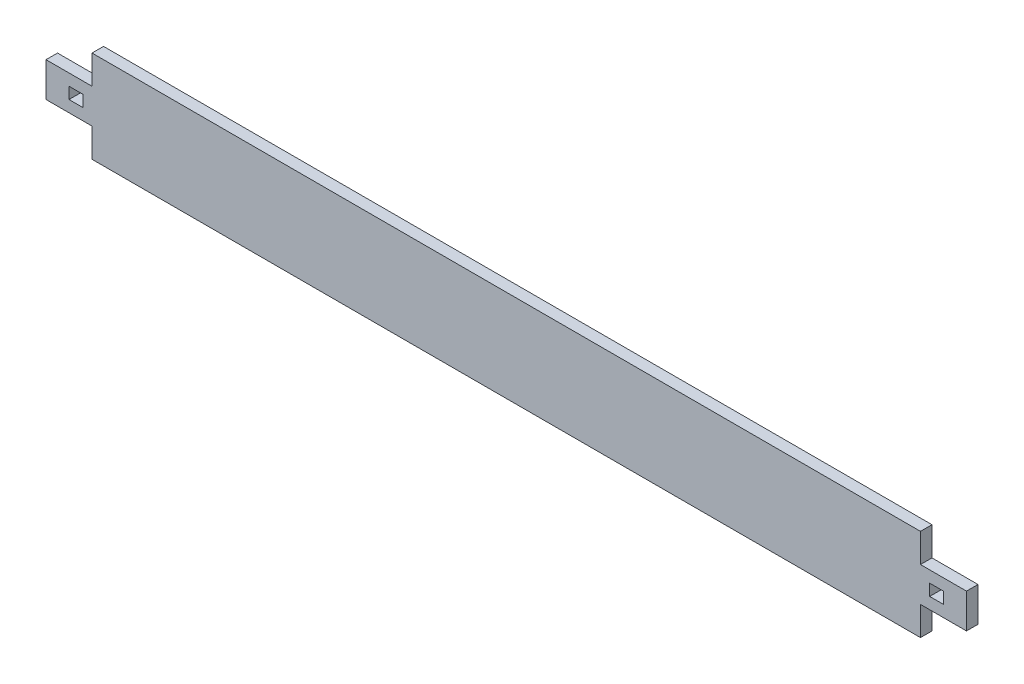
ISO-10303-21;
HEADER;
FILE_DESCRIPTION(('STEP AP214'),'2;1');
FILE_NAME('part.step','',(''),(''),'','','');
FILE_SCHEMA(('AUTOMOTIVE_DESIGN { 1 0 10303 214 1 1 1 1 }'));
ENDSEC;
DATA;
#1=APPLICATION_CONTEXT('core data for automotive mechanical design processes');
#2=APPLICATION_PROTOCOL_DEFINITION('international standard','automotive_design',2000,#1);
#3=PRODUCT_CONTEXT('',#1,'mechanical');
#4=PRODUCT('Part','Part','',(#3));
#5=PRODUCT_RELATED_PRODUCT_CATEGORY('part','',(#4));
#6=PRODUCT_DEFINITION_FORMATION('','',#4);
#7=PRODUCT_DEFINITION_CONTEXT('part definition',#1,'design');
#8=PRODUCT_DEFINITION('design','',#6,#7);
#9=PRODUCT_DEFINITION_SHAPE('','',#8);
#10=(LENGTH_UNIT() NAMED_UNIT(*) SI_UNIT(.MILLI.,.METRE.));
#11=(NAMED_UNIT(*) PLANE_ANGLE_UNIT() SI_UNIT($,.RADIAN.));
#12=(NAMED_UNIT(*) SI_UNIT($,.STERADIAN.) SOLID_ANGLE_UNIT());
#13=UNCERTAINTY_MEASURE_WITH_UNIT(LENGTH_MEASURE(1.E-05),#10,'distance_accuracy_value','');
#14=(GEOMETRIC_REPRESENTATION_CONTEXT(3) GLOBAL_UNCERTAINTY_ASSIGNED_CONTEXT((#13)) GLOBAL_UNIT_ASSIGNED_CONTEXT((#10,
#11,#12)) REPRESENTATION_CONTEXT('',''));
#15=CARTESIAN_POINT('',(0.,0.,0.));
#16=DIRECTION('',(0.,0.,1.));
#17=DIRECTION('',(1.,0.,0.));
#18=AXIS2_PLACEMENT_3D('',#15,#16,#17);
#19=CARTESIAN_POINT('',(0.,0.,6.35));
#20=DIRECTION('',(0.,0.,-1.));
#21=DIRECTION('',(-1.,0.,0.));
#22=AXIS2_PLACEMENT_3D('',#19,#20,#21);
#23=PLANE('',#22);
#24=DIRECTION('',(1.,0.,0.));
#25=VECTOR('',#24,1.);
#26=CARTESIAN_POINT('',(-241.3,-3.175,6.35));
#27=LINE('',#26,#25);
#28=CARTESIAN_POINT('',(-241.3,-3.175,6.35));
#29=VERTEX_POINT('',#28);
#30=CARTESIAN_POINT('',(-233.68,-3.175,6.35));
#31=VERTEX_POINT('',#30);
#32=EDGE_CURVE('E247',#29,#31,#27,.T.);
#33=ORIENTED_EDGE('',*,*,#32,.F.);
#34=DIRECTION('',(0.,-1.,0.));
#35=VECTOR('',#34,1.);
#36=CARTESIAN_POINT('',(-241.3,3.175,6.35));
#37=LINE('',#36,#35);
#38=CARTESIAN_POINT('',(-241.3,3.175,6.35));
#39=VERTEX_POINT('',#38);
#40=EDGE_CURVE('E231',#39,#29,#37,.T.);
#41=ORIENTED_EDGE('',*,*,#40,.F.);
#42=DIRECTION('',(-1.,0.,0.));
#43=VECTOR('',#42,1.);
#44=CARTESIAN_POINT('',(-241.3,3.175,6.35));
#45=LINE('',#44,#43);
#46=CARTESIAN_POINT('',(-233.68,3.175,6.35));
#47=VERTEX_POINT('',#46);
#48=EDGE_CURVE('E236',#47,#39,#45,.T.);
#49=ORIENTED_EDGE('',*,*,#48,.F.);
#50=DIRECTION('',(0.,1.,0.));
#51=VECTOR('',#50,1.);
#52=CARTESIAN_POINT('',(-233.68,3.175,6.35));
#53=LINE('',#52,#51);
#54=EDGE_CURVE('E250',#31,#47,#53,.T.);
#55=ORIENTED_EDGE('',*,*,#54,.F.);
#56=EDGE_LOOP('',(#33,#41,#49,#55));
#57=FACE_BOUND('',#56,.T.);
#58=DIRECTION('',(0.,1.,0.));
#59=VECTOR('',#58,1.);
#60=CARTESIAN_POINT('',(228.6,-25.4,6.35));
#61=LINE('',#60,#59);
#62=CARTESIAN_POINT('',(228.6,-25.4,6.35));
#63=VERTEX_POINT('',#62);
#64=CARTESIAN_POINT('',(228.6,-9.52499999999996,6.35));
#65=VERTEX_POINT('',#64);
#66=EDGE_CURVE('E290',#63,#65,#61,.T.);
#67=ORIENTED_EDGE('',*,*,#66,.T.);
#68=DIRECTION('',(-1.,0.,0.));
#69=VECTOR('',#68,1.);
#70=CARTESIAN_POINT('',(254.,-9.52499999999996,6.35));
#71=LINE('',#70,#69);
#72=CARTESIAN_POINT('',(254.,-9.52499999999996,6.35));
#73=VERTEX_POINT('',#72);
#74=EDGE_CURVE('E211',#73,#65,#71,.T.);
#75=ORIENTED_EDGE('',*,*,#74,.F.);
#76=DIRECTION('',(0.,-1.,0.));
#77=VECTOR('',#76,1.);
#78=CARTESIAN_POINT('',(254.,-9.52499999999996,6.35));
#79=LINE('',#78,#77);
#80=CARTESIAN_POINT('',(254.,9.52500000000004,6.35));
#81=VERTEX_POINT('',#80);
#82=EDGE_CURVE('E207',#81,#73,#79,.T.);
#83=ORIENTED_EDGE('',*,*,#82,.F.);
#84=DIRECTION('',(1.,0.,0.));
#85=VECTOR('',#84,1.);
#86=CARTESIAN_POINT('',(254.,9.52500000000004,6.35));
#87=LINE('',#86,#85);
#88=CARTESIAN_POINT('',(228.6,9.52500000000004,6.35));
#89=VERTEX_POINT('',#88);
#90=EDGE_CURVE('E201',#89,#81,#87,.T.);
#91=ORIENTED_EDGE('',*,*,#90,.F.);
#92=CARTESIAN_POINT('',(228.6,25.4,6.35));
#93=VERTEX_POINT('',#92);
#94=EDGE_CURVE('E294',#89,#93,#61,.T.);
#95=ORIENTED_EDGE('',*,*,#94,.T.);
#96=DIRECTION('',(-1.,0.,0.));
#97=VECTOR('',#96,1.);
#98=CARTESIAN_POINT('',(-228.6,25.4,6.35));
#99=LINE('',#98,#97);
#100=CARTESIAN_POINT('',(-228.6,25.4,6.35));
#101=VERTEX_POINT('',#100);
#102=EDGE_CURVE('E293',#93,#101,#99,.T.);
#103=ORIENTED_EDGE('',*,*,#102,.T.);
#104=DIRECTION('',(0.,-1.,0.));
#105=VECTOR('',#104,1.);
#106=CARTESIAN_POINT('',(-228.6,-25.4,6.35));
#107=LINE('',#106,#105);
#108=CARTESIAN_POINT('',(-228.6,9.52500000000004,6.35));
#109=VERTEX_POINT('',#108);
#110=EDGE_CURVE('E297',#101,#109,#107,.T.);
#111=ORIENTED_EDGE('',*,*,#110,.T.);
#112=DIRECTION('',(-1.,0.,0.));
#113=VECTOR('',#112,1.);
#114=CARTESIAN_POINT('',(-254.,9.52500000000004,6.35));
#115=LINE('',#114,#113);
#116=CARTESIAN_POINT('',(-254.,9.52500000000004,6.35));
#117=VERTEX_POINT('',#116);
#118=EDGE_CURVE('E257',#109,#117,#115,.T.);
#119=ORIENTED_EDGE('',*,*,#118,.T.);
#120=DIRECTION('',(0.,-1.,0.));
#121=VECTOR('',#120,1.);
#122=CARTESIAN_POINT('',(-254.,-9.52499999999996,6.35));
#123=LINE('',#122,#121);
#124=CARTESIAN_POINT('',(-254.,-9.52499999999996,6.35));
#125=VERTEX_POINT('',#124);
#126=EDGE_CURVE('E268',#117,#125,#123,.T.);
#127=ORIENTED_EDGE('',*,*,#126,.T.);
#128=DIRECTION('',(1.,0.,0.));
#129=VECTOR('',#128,1.);
#130=CARTESIAN_POINT('',(-254.,-9.52499999999996,6.35));
#131=LINE('',#130,#129);
#132=CARTESIAN_POINT('',(-228.6,-9.52499999999996,6.35));
#133=VERTEX_POINT('',#132);
#134=EDGE_CURVE('E264',#125,#133,#131,.T.);
#135=ORIENTED_EDGE('',*,*,#134,.T.);
#136=CARTESIAN_POINT('',(-228.6,-25.4,6.35));
#137=VERTEX_POINT('',#136);
#138=EDGE_CURVE('E296',#133,#137,#107,.T.);
#139=ORIENTED_EDGE('',*,*,#138,.T.);
#140=DIRECTION('',(1.,0.,0.));
#141=VECTOR('',#140,1.);
#142=CARTESIAN_POINT('',(-228.6,-25.4,6.35));
#143=LINE('',#142,#141);
#144=EDGE_CURVE('E300',#137,#63,#143,.T.);
#145=ORIENTED_EDGE('',*,*,#144,.T.);
#146=EDGE_LOOP('',(#67,#75,#83,#91,#95,#103,#111,#119,#127,#135,#139,#145));
#147=FACE_BOUND('',#146,.T.);
#148=DIRECTION('',(0.,-1.,0.));
#149=VECTOR('',#148,1.);
#150=CARTESIAN_POINT('',(241.3,3.175,6.35));
#151=LINE('',#150,#149);
#152=CARTESIAN_POINT('',(241.3,3.175,6.35));
#153=VERTEX_POINT('',#152);
#154=CARTESIAN_POINT('',(241.3,-3.175,6.35));
#155=VERTEX_POINT('',#154);
#156=EDGE_CURVE('E48',#153,#155,#151,.T.);
#157=ORIENTED_EDGE('',*,*,#156,.T.);
#158=DIRECTION('',(-1.,0.,0.));
#159=VECTOR('',#158,1.);
#160=CARTESIAN_POINT('',(241.3,-3.175,6.35));
#161=LINE('',#160,#159);
#162=CARTESIAN_POINT('',(233.68,-3.175,6.35));
#163=VERTEX_POINT('',#162);
#164=EDGE_CURVE('E186',#155,#163,#161,.T.);
#165=ORIENTED_EDGE('',*,*,#164,.T.);
#166=DIRECTION('',(0.,1.,0.));
#167=VECTOR('',#166,1.);
#168=CARTESIAN_POINT('',(233.68,3.175,6.35));
#169=LINE('',#168,#167);
#170=CARTESIAN_POINT('',(233.68,3.175,6.35));
#171=VERTEX_POINT('',#170);
#172=EDGE_CURVE('E189',#163,#171,#169,.T.);
#173=ORIENTED_EDGE('',*,*,#172,.T.);
#174=DIRECTION('',(1.,0.,0.));
#175=VECTOR('',#174,1.);
#176=CARTESIAN_POINT('',(241.3,3.175,6.35));
#177=LINE('',#176,#175);
#178=EDGE_CURVE('E195',#171,#153,#177,.T.);
#179=ORIENTED_EDGE('',*,*,#178,.T.);
#180=EDGE_LOOP('',(#157,#165,#173,#179));
#181=FACE_BOUND('',#180,.T.);
#182=ADVANCED_FACE('F33',(#57,#147,#181),#23,.F.);
#183=CARTESIAN_POINT('',(0.,0.,0.));
#184=DIRECTION('',(0.,0.,-1.));
#185=DIRECTION('',(-1.,0.,0.));
#186=AXIS2_PLACEMENT_3D('',#183,#184,#185);
#187=PLANE('',#186);
#188=DIRECTION('',(0.,-1.,0.));
#189=VECTOR('',#188,1.);
#190=CARTESIAN_POINT('',(-241.3,3.175,0.));
#191=LINE('',#190,#189);
#192=CARTESIAN_POINT('',(-241.3,3.175,0.));
#193=VERTEX_POINT('',#192);
#194=CARTESIAN_POINT('',(-241.3,-3.175,0.));
#195=VERTEX_POINT('',#194);
#196=EDGE_CURVE('E232',#193,#195,#191,.T.);
#197=ORIENTED_EDGE('',*,*,#196,.T.);
#198=DIRECTION('',(1.,0.,0.));
#199=VECTOR('',#198,1.);
#200=CARTESIAN_POINT('',(-241.3,-3.175,0.));
#201=LINE('',#200,#199);
#202=CARTESIAN_POINT('',(-233.68,-3.175,0.));
#203=VERTEX_POINT('',#202);
#204=EDGE_CURVE('E235',#195,#203,#201,.T.);
#205=ORIENTED_EDGE('',*,*,#204,.T.);
#206=DIRECTION('',(0.,1.,0.));
#207=VECTOR('',#206,1.);
#208=CARTESIAN_POINT('',(-233.68,3.175,0.));
#209=LINE('',#208,#207);
#210=CARTESIAN_POINT('',(-233.68,3.175,0.));
#211=VERTEX_POINT('',#210);
#212=EDGE_CURVE('E239',#203,#211,#209,.T.);
#213=ORIENTED_EDGE('',*,*,#212,.T.);
#214=DIRECTION('',(-1.,0.,0.));
#215=VECTOR('',#214,1.);
#216=CARTESIAN_POINT('',(-241.3,3.175,0.));
#217=LINE('',#216,#215);
#218=EDGE_CURVE('E242',#211,#193,#217,.T.);
#219=ORIENTED_EDGE('',*,*,#218,.T.);
#220=EDGE_LOOP('',(#197,#205,#213,#219));
#221=FACE_BOUND('',#220,.T.);
#222=DIRECTION('',(0.,1.,0.));
#223=VECTOR('',#222,1.);
#224=CARTESIAN_POINT('',(228.6,-25.4,0.));
#225=LINE('',#224,#223);
#226=CARTESIAN_POINT('',(228.6,9.52500000000004,0.));
#227=VERTEX_POINT('',#226);
#228=CARTESIAN_POINT('',(228.6,25.4,0.));
#229=VERTEX_POINT('',#228);
#230=EDGE_CURVE('E289',#227,#229,#225,.T.);
#231=ORIENTED_EDGE('',*,*,#230,.F.);
#232=DIRECTION('',(1.,0.,0.));
#233=VECTOR('',#232,1.);
#234=CARTESIAN_POINT('',(254.,9.52500000000004,0.));
#235=LINE('',#234,#233);
#236=CARTESIAN_POINT('',(254.,9.52500000000004,0.));
#237=VERTEX_POINT('',#236);
#238=EDGE_CURVE('E219',#227,#237,#235,.T.);
#239=ORIENTED_EDGE('',*,*,#238,.T.);
#240=DIRECTION('',(0.,-1.,0.));
#241=VECTOR('',#240,1.);
#242=CARTESIAN_POINT('',(254.,-9.52499999999996,0.));
#243=LINE('',#242,#241);
#244=CARTESIAN_POINT('',(254.,-9.52499999999996,0.));
#245=VERTEX_POINT('',#244);
#246=EDGE_CURVE('E215',#237,#245,#243,.T.);
#247=ORIENTED_EDGE('',*,*,#246,.T.);
#248=DIRECTION('',(-1.,0.,0.));
#249=VECTOR('',#248,1.);
#250=CARTESIAN_POINT('',(254.,-9.52499999999996,0.));
#251=LINE('',#250,#249);
#252=CARTESIAN_POINT('',(228.6,-9.52499999999996,0.));
#253=VERTEX_POINT('',#252);
#254=EDGE_CURVE('E214',#245,#253,#251,.T.);
#255=ORIENTED_EDGE('',*,*,#254,.T.);
#256=CARTESIAN_POINT('',(228.6,-25.4,0.));
#257=VERTEX_POINT('',#256);
#258=EDGE_CURVE('E303',#257,#253,#225,.T.);
#259=ORIENTED_EDGE('',*,*,#258,.F.);
#260=DIRECTION('',(1.,0.,0.));
#261=VECTOR('',#260,1.);
#262=CARTESIAN_POINT('',(-228.6,-25.4,0.));
#263=LINE('',#262,#261);
#264=CARTESIAN_POINT('',(-228.6,-25.4,0.));
#265=VERTEX_POINT('',#264);
#266=EDGE_CURVE('E311',#265,#257,#263,.T.);
#267=ORIENTED_EDGE('',*,*,#266,.F.);
#268=DIRECTION('',(0.,-1.,0.));
#269=VECTOR('',#268,1.);
#270=CARTESIAN_POINT('',(-228.6,-25.4,0.));
#271=LINE('',#270,#269);
#272=CARTESIAN_POINT('',(-228.6,-9.52499999999996,0.));
#273=VERTEX_POINT('',#272);
#274=EDGE_CURVE('E307',#273,#265,#271,.T.);
#275=ORIENTED_EDGE('',*,*,#274,.F.);
#276=DIRECTION('',(1.,0.,0.));
#277=VECTOR('',#276,1.);
#278=CARTESIAN_POINT('',(-254.,-9.52499999999996,0.));
#279=LINE('',#278,#277);
#280=CARTESIAN_POINT('',(-254.,-9.52499999999996,0.));
#281=VERTEX_POINT('',#280);
#282=EDGE_CURVE('E274',#281,#273,#279,.T.);
#283=ORIENTED_EDGE('',*,*,#282,.F.);
#284=DIRECTION('',(0.,-1.,0.));
#285=VECTOR('',#284,1.);
#286=CARTESIAN_POINT('',(-254.,-9.52499999999996,0.));
#287=LINE('',#286,#285);
#288=CARTESIAN_POINT('',(-254.,9.52500000000004,0.));
#289=VERTEX_POINT('',#288);
#290=EDGE_CURVE('E278',#289,#281,#287,.T.);
#291=ORIENTED_EDGE('',*,*,#290,.F.);
#292=DIRECTION('',(-1.,0.,0.));
#293=VECTOR('',#292,1.);
#294=CARTESIAN_POINT('',(-254.,9.52500000000004,0.));
#295=LINE('',#294,#293);
#296=CARTESIAN_POINT('',(-228.6,9.52500000000004,0.));
#297=VERTEX_POINT('',#296);
#298=EDGE_CURVE('E267',#297,#289,#295,.T.);
#299=ORIENTED_EDGE('',*,*,#298,.F.);
#300=CARTESIAN_POINT('',(-228.6,25.4,0.));
#301=VERTEX_POINT('',#300);
#302=EDGE_CURVE('E308',#301,#297,#271,.T.);
#303=ORIENTED_EDGE('',*,*,#302,.F.);
#304=DIRECTION('',(-1.,0.,0.));
#305=VECTOR('',#304,1.);
#306=CARTESIAN_POINT('',(-228.6,25.4,0.));
#307=LINE('',#306,#305);
#308=EDGE_CURVE('E305',#229,#301,#307,.T.);
#309=ORIENTED_EDGE('',*,*,#308,.F.);
#310=EDGE_LOOP('',(#231,#239,#247,#255,#259,#267,#275,#283,#291,#299,#303,#309));
#311=FACE_BOUND('',#310,.T.);
#312=DIRECTION('',(-1.,0.,0.));
#313=VECTOR('',#312,1.);
#314=CARTESIAN_POINT('',(241.3,-3.175,0.));
#315=LINE('',#314,#313);
#316=CARTESIAN_POINT('',(241.3,-3.175,0.));
#317=VERTEX_POINT('',#316);
#318=CARTESIAN_POINT('',(233.68,-3.175,0.));
#319=VERTEX_POINT('',#318);
#320=EDGE_CURVE('E182',#317,#319,#315,.T.);
#321=ORIENTED_EDGE('',*,*,#320,.F.);
#322=DIRECTION('',(0.,-1.,0.));
#323=VECTOR('',#322,1.);
#324=CARTESIAN_POINT('',(241.3,3.175,0.));
#325=LINE('',#324,#323);
#326=CARTESIAN_POINT('',(241.3,3.175,0.));
#327=VERTEX_POINT('',#326);
#328=EDGE_CURVE('E178',#327,#317,#325,.T.);
#329=ORIENTED_EDGE('',*,*,#328,.F.);
#330=DIRECTION('',(1.,0.,0.));
#331=VECTOR('',#330,1.);
#332=CARTESIAN_POINT('',(241.3,3.175,0.));
#333=LINE('',#332,#331);
#334=CARTESIAN_POINT('',(233.68,3.175,0.));
#335=VERTEX_POINT('',#334);
#336=EDGE_CURVE('E170',#335,#327,#333,.T.);
#337=ORIENTED_EDGE('',*,*,#336,.F.);
#338=DIRECTION('',(0.,1.,0.));
#339=VECTOR('',#338,1.);
#340=CARTESIAN_POINT('',(233.68,3.175,0.));
#341=LINE('',#340,#339);
#342=EDGE_CURVE('E177',#319,#335,#341,.T.);
#343=ORIENTED_EDGE('',*,*,#342,.F.);
#344=EDGE_LOOP('',(#321,#329,#337,#343));
#345=FACE_BOUND('',#344,.T.);
#346=ADVANCED_FACE('F185',(#221,#311,#345),#187,.T.);
#347=CARTESIAN_POINT('',(228.6,-25.4,6.35));
#348=DIRECTION('',(-1.,0.,0.));
#349=DIRECTION('',(0.,0.,1.));
#350=AXIS2_PLACEMENT_3D('',#347,#348,#349);
#351=PLANE('',#350);
#352=DIRECTION('',(0.,0.,1.));
#353=VECTOR('',#352,1.);
#354=CARTESIAN_POINT('',(228.6,9.52500000000003,6.35));
#355=LINE('',#354,#353);
#356=EDGE_CURVE('E228',#227,#89,#355,.T.);
#357=ORIENTED_EDGE('',*,*,#356,.F.);
#358=ORIENTED_EDGE('',*,*,#230,.T.);
#359=DIRECTION('',(0.,0.,-1.));
#360=VECTOR('',#359,1.);
#361=CARTESIAN_POINT('',(228.6,25.4,6.35));
#362=LINE('',#361,#360);
#363=EDGE_CURVE('E11',#93,#229,#362,.T.);
#364=ORIENTED_EDGE('',*,*,#363,.F.);
#365=ORIENTED_EDGE('',*,*,#94,.F.);
#366=EDGE_LOOP('',(#357,#358,#364,#365));
#367=FACE_BOUND('',#366,.T.);
#368=ADVANCED_FACE('F35',(#367),#351,.F.);
#369=DIRECTION('',(0.,0.,-1.));
#370=VECTOR('',#369,1.);
#371=CARTESIAN_POINT('',(228.6,-9.52499999999996,6.35));
#372=LINE('',#371,#370);
#373=EDGE_CURVE('E218',#65,#253,#372,.T.);
#374=ORIENTED_EDGE('',*,*,#373,.F.);
#375=ORIENTED_EDGE('',*,*,#66,.F.);
#376=DIRECTION('',(0.,0.,-1.));
#377=VECTOR('',#376,1.);
#378=CARTESIAN_POINT('',(228.6,-25.4,6.35));
#379=LINE('',#378,#377);
#380=EDGE_CURVE('E302',#63,#257,#379,.T.);
#381=ORIENTED_EDGE('',*,*,#380,.T.);
#382=ORIENTED_EDGE('',*,*,#258,.T.);
#383=EDGE_LOOP('',(#374,#375,#381,#382));
#384=FACE_BOUND('',#383,.T.);
#385=ADVANCED_FACE('F357',(#384),#351,.F.);
#386=CARTESIAN_POINT('',(-228.6,-25.4,6.35));
#387=DIRECTION('',(1.,0.,0.));
#388=DIRECTION('',(0.,0.,-1.));
#389=AXIS2_PLACEMENT_3D('',#386,#387,#388);
#390=PLANE('',#389);
#391=ORIENTED_EDGE('',*,*,#302,.T.);
#392=DIRECTION('',(0.,0.,1.));
#393=VECTOR('',#392,1.);
#394=CARTESIAN_POINT('',(-228.6,9.52500000000003,6.35));
#395=LINE('',#394,#393);
#396=EDGE_CURVE('E286',#297,#109,#395,.T.);
#397=ORIENTED_EDGE('',*,*,#396,.T.);
#398=ORIENTED_EDGE('',*,*,#110,.F.);
#399=DIRECTION('',(0.,0.,-1.));
#400=VECTOR('',#399,1.);
#401=CARTESIAN_POINT('',(-228.6,25.4,6.35));
#402=LINE('',#401,#400);
#403=EDGE_CURVE('E41',#101,#301,#402,.T.);
#404=ORIENTED_EDGE('',*,*,#403,.T.);
#405=EDGE_LOOP('',(#391,#397,#398,#404));
#406=FACE_BOUND('',#405,.T.);
#407=ADVANCED_FACE('F322',(#406),#390,.F.);
#408=CARTESIAN_POINT('',(-228.6,25.4,6.35));
#409=DIRECTION('',(0.,-1.,0.));
#410=DIRECTION('',(0.,0.,-1.));
#411=AXIS2_PLACEMENT_3D('',#408,#409,#410);
#412=PLANE('',#411);
#413=ORIENTED_EDGE('',*,*,#308,.T.);
#414=ORIENTED_EDGE('',*,*,#403,.F.);
#415=ORIENTED_EDGE('',*,*,#102,.F.);
#416=ORIENTED_EDGE('',*,*,#363,.T.);
#417=EDGE_LOOP('',(#413,#414,#415,#416));
#418=FACE_BOUND('',#417,.T.);
#419=ADVANCED_FACE('F337',(#418),#412,.F.);
#420=ORIENTED_EDGE('',*,*,#138,.F.);
#421=DIRECTION('',(0.,0.,-1.));
#422=VECTOR('',#421,1.);
#423=CARTESIAN_POINT('',(-228.6,-9.52499999999996,6.35));
#424=LINE('',#423,#422);
#425=EDGE_CURVE('E276',#133,#273,#424,.T.);
#426=ORIENTED_EDGE('',*,*,#425,.T.);
#427=ORIENTED_EDGE('',*,*,#274,.T.);
#428=DIRECTION('',(0.,0.,-1.));
#429=VECTOR('',#428,1.);
#430=CARTESIAN_POINT('',(-228.6,-25.4,6.35));
#431=LINE('',#430,#429);
#432=EDGE_CURVE('E315',#137,#265,#431,.T.);
#433=ORIENTED_EDGE('',*,*,#432,.F.);
#434=EDGE_LOOP('',(#420,#426,#427,#433));
#435=FACE_BOUND('',#434,.T.);
#436=ADVANCED_FACE('F365',(#435),#390,.F.);
#437=CARTESIAN_POINT('',(-228.6,-25.4,6.35));
#438=DIRECTION('',(0.,1.,0.));
#439=DIRECTION('',(0.,0.,1.));
#440=AXIS2_PLACEMENT_3D('',#437,#438,#439);
#441=PLANE('',#440);
#442=ORIENTED_EDGE('',*,*,#266,.T.);
#443=ORIENTED_EDGE('',*,*,#380,.F.);
#444=ORIENTED_EDGE('',*,*,#144,.F.);
#445=ORIENTED_EDGE('',*,*,#432,.T.);
#446=EDGE_LOOP('',(#442,#443,#444,#445));
#447=FACE_BOUND('',#446,.T.);
#448=ADVANCED_FACE('F361',(#447),#441,.F.);
#449=CARTESIAN_POINT('',(-254.,9.52500000000004,-54.2544237827663));
#450=DIRECTION('',(0.,1.,0.));
#451=DIRECTION('',(-1.,0.,0.));
#452=AXIS2_PLACEMENT_3D('',#449,#450,#451);
#453=PLANE('',#452);
#454=ORIENTED_EDGE('',*,*,#396,.F.);
#455=ORIENTED_EDGE('',*,*,#298,.T.);
#456=DIRECTION('',(0.,0.,1.));
#457=VECTOR('',#456,1.);
#458=CARTESIAN_POINT('',(-254.,9.52500000000004,-54.2544237827663));
#459=LINE('',#458,#457);
#460=EDGE_CURVE('E273',#289,#117,#459,.T.);
#461=ORIENTED_EDGE('',*,*,#460,.T.);
#462=ORIENTED_EDGE('',*,*,#118,.F.);
#463=EDGE_LOOP('',(#454,#455,#461,#462));
#464=FACE_BOUND('',#463,.T.);
#465=ADVANCED_FACE('F331',(#464),#453,.T.);
#466=CARTESIAN_POINT('',(-254.,-9.52499999999996,-54.2544237827663));
#467=DIRECTION('',(0.,-1.,0.));
#468=DIRECTION('',(1.,0.,0.));
#469=AXIS2_PLACEMENT_3D('',#466,#467,#468);
#470=PLANE('',#469);
#471=ORIENTED_EDGE('',*,*,#425,.F.);
#472=ORIENTED_EDGE('',*,*,#134,.F.);
#473=DIRECTION('',(0.,0.,1.));
#474=VECTOR('',#473,1.);
#475=CARTESIAN_POINT('',(-254.,-9.52499999999996,-54.2544237827663));
#476=LINE('',#475,#474);
#477=EDGE_CURVE('E277',#281,#125,#476,.T.);
#478=ORIENTED_EDGE('',*,*,#477,.F.);
#479=ORIENTED_EDGE('',*,*,#282,.T.);
#480=EDGE_LOOP('',(#471,#472,#478,#479));
#481=FACE_BOUND('',#480,.T.);
#482=ADVANCED_FACE('F369',(#481),#470,.T.);
#483=CARTESIAN_POINT('',(-254.,-9.52499999999996,-54.2544237827663));
#484=DIRECTION('',(-1.,0.,0.));
#485=DIRECTION('',(0.,0.,1.));
#486=AXIS2_PLACEMENT_3D('',#483,#484,#485);
#487=PLANE('',#486);
#488=ORIENTED_EDGE('',*,*,#460,.F.);
#489=ORIENTED_EDGE('',*,*,#290,.T.);
#490=ORIENTED_EDGE('',*,*,#477,.T.);
#491=ORIENTED_EDGE('',*,*,#126,.F.);
#492=EDGE_LOOP('',(#488,#489,#490,#491));
#493=FACE_BOUND('',#492,.T.);
#494=ADVANCED_FACE('F371',(#493),#487,.T.);
#495=CARTESIAN_POINT('',(-241.3,3.175,0.));
#496=DIRECTION('',(-1.,0.,0.));
#497=DIRECTION('',(0.,0.,1.));
#498=AXIS2_PLACEMENT_3D('',#495,#496,#497);
#499=PLANE('',#498);
#500=ORIENTED_EDGE('',*,*,#40,.T.);
#501=DIRECTION('',(0.,0.,1.));
#502=VECTOR('',#501,1.);
#503=CARTESIAN_POINT('',(-241.3,-3.175,0.));
#504=LINE('',#503,#502);
#505=EDGE_CURVE('E245',#195,#29,#504,.T.);
#506=ORIENTED_EDGE('',*,*,#505,.F.);
#507=ORIENTED_EDGE('',*,*,#196,.F.);
#508=DIRECTION('',(0.,0.,1.));
#509=VECTOR('',#508,1.);
#510=CARTESIAN_POINT('',(-241.3,3.175,0.));
#511=LINE('',#510,#509);
#512=EDGE_CURVE('E255',#193,#39,#511,.T.);
#513=ORIENTED_EDGE('',*,*,#512,.T.);
#514=EDGE_LOOP('',(#500,#506,#507,#513));
#515=FACE_BOUND('',#514,.T.);
#516=ADVANCED_FACE('F373',(#515),#499,.F.);
#517=CARTESIAN_POINT('',(-241.3,3.175,0.));
#518=DIRECTION('',(0.,1.,0.));
#519=DIRECTION('',(0.,0.,1.));
#520=AXIS2_PLACEMENT_3D('',#517,#518,#519);
#521=PLANE('',#520);
#522=ORIENTED_EDGE('',*,*,#48,.T.);
#523=ORIENTED_EDGE('',*,*,#512,.F.);
#524=ORIENTED_EDGE('',*,*,#218,.F.);
#525=DIRECTION('',(0.,0.,1.));
#526=VECTOR('',#525,1.);
#527=CARTESIAN_POINT('',(-233.68,3.175,0.));
#528=LINE('',#527,#526);
#529=EDGE_CURVE('E258',#211,#47,#528,.T.);
#530=ORIENTED_EDGE('',*,*,#529,.T.);
#531=EDGE_LOOP('',(#522,#523,#524,#530));
#532=FACE_BOUND('',#531,.T.);
#533=ADVANCED_FACE('F379',(#532),#521,.F.);
#534=CARTESIAN_POINT('',(-233.68,3.175,0.));
#535=DIRECTION('',(1.,0.,0.));
#536=DIRECTION('',(0.,0.,-1.));
#537=AXIS2_PLACEMENT_3D('',#534,#535,#536);
#538=PLANE('',#537);
#539=ORIENTED_EDGE('',*,*,#54,.T.);
#540=ORIENTED_EDGE('',*,*,#529,.F.);
#541=ORIENTED_EDGE('',*,*,#212,.F.);
#542=DIRECTION('',(0.,0.,1.));
#543=VECTOR('',#542,1.);
#544=CARTESIAN_POINT('',(-233.68,-3.175,0.));
#545=LINE('',#544,#543);
#546=EDGE_CURVE('E260',#203,#31,#545,.T.);
#547=ORIENTED_EDGE('',*,*,#546,.T.);
#548=EDGE_LOOP('',(#539,#540,#541,#547));
#549=FACE_BOUND('',#548,.T.);
#550=ADVANCED_FACE('F431',(#549),#538,.F.);
#551=CARTESIAN_POINT('',(-241.3,-3.175,0.));
#552=DIRECTION('',(0.,-1.,0.));
#553=DIRECTION('',(0.,0.,-1.));
#554=AXIS2_PLACEMENT_3D('',#551,#552,#553);
#555=PLANE('',#554);
#556=ORIENTED_EDGE('',*,*,#32,.T.);
#557=ORIENTED_EDGE('',*,*,#546,.F.);
#558=ORIENTED_EDGE('',*,*,#204,.F.);
#559=ORIENTED_EDGE('',*,*,#505,.T.);
#560=EDGE_LOOP('',(#556,#557,#558,#559));
#561=FACE_BOUND('',#560,.T.);
#562=ADVANCED_FACE('F426',(#561),#555,.F.);
#563=CARTESIAN_POINT('',(254.,9.52500000000004,-54.2544237827663));
#564=DIRECTION('',(0.,-1.,0.));
#565=DIRECTION('',(1.,0.,0.));
#566=AXIS2_PLACEMENT_3D('',#563,#564,#565);
#567=PLANE('',#566);
#568=ORIENTED_EDGE('',*,*,#238,.F.);
#569=ORIENTED_EDGE('',*,*,#356,.T.);
#570=ORIENTED_EDGE('',*,*,#90,.T.);
#571=DIRECTION('',(0.,0.,1.));
#572=VECTOR('',#571,1.);
#573=CARTESIAN_POINT('',(254.,9.52500000000004,-54.2544237827663));
#574=LINE('',#573,#572);
#575=EDGE_CURVE('E206',#237,#81,#574,.T.);
#576=ORIENTED_EDGE('',*,*,#575,.F.);
#577=EDGE_LOOP('',(#568,#569,#570,#576));
#578=FACE_BOUND('',#577,.T.);
#579=ADVANCED_FACE('F348',(#578),#567,.F.);
#580=CARTESIAN_POINT('',(254.,-9.52499999999996,-54.2544237827663));
#581=DIRECTION('',(0.,1.,0.));
#582=DIRECTION('',(-1.,0.,0.));
#583=AXIS2_PLACEMENT_3D('',#580,#581,#582);
#584=PLANE('',#583);
#585=ORIENTED_EDGE('',*,*,#74,.T.);
#586=ORIENTED_EDGE('',*,*,#373,.T.);
#587=ORIENTED_EDGE('',*,*,#254,.F.);
#588=DIRECTION('',(0.,0.,1.));
#589=VECTOR('',#588,1.);
#590=CARTESIAN_POINT('',(254.,-9.52499999999996,-54.2544237827663));
#591=LINE('',#590,#589);
#592=EDGE_CURVE('E210',#245,#73,#591,.T.);
#593=ORIENTED_EDGE('',*,*,#592,.T.);
#594=EDGE_LOOP('',(#585,#586,#587,#593));
#595=FACE_BOUND('',#594,.T.);
#596=ADVANCED_FACE('F352',(#595),#584,.F.);
#597=CARTESIAN_POINT('',(254.,-9.52499999999996,-54.2544237827663));
#598=DIRECTION('',(-1.,0.,0.));
#599=DIRECTION('',(0.,0.,1.));
#600=AXIS2_PLACEMENT_3D('',#597,#598,#599);
#601=PLANE('',#600);
#602=ORIENTED_EDGE('',*,*,#246,.F.);
#603=ORIENTED_EDGE('',*,*,#575,.T.);
#604=ORIENTED_EDGE('',*,*,#82,.T.);
#605=ORIENTED_EDGE('',*,*,#592,.F.);
#606=EDGE_LOOP('',(#602,#603,#604,#605));
#607=FACE_BOUND('',#606,.T.);
#608=ADVANCED_FACE('F345',(#607),#601,.F.);
#609=CARTESIAN_POINT('',(241.3,3.175,0.));
#610=DIRECTION('',(-1.,0.,0.));
#611=DIRECTION('',(0.,0.,1.));
#612=AXIS2_PLACEMENT_3D('',#609,#610,#611);
#613=PLANE('',#612);
#614=ORIENTED_EDGE('',*,*,#156,.F.);
#615=DIRECTION('',(0.,0.,1.));
#616=VECTOR('',#615,1.);
#617=CARTESIAN_POINT('',(241.3,3.175,0.));
#618=LINE('',#617,#616);
#619=EDGE_CURVE('E172',#327,#153,#618,.T.);
#620=ORIENTED_EDGE('',*,*,#619,.F.);
#621=ORIENTED_EDGE('',*,*,#328,.T.);
#622=DIRECTION('',(0.,0.,1.));
#623=VECTOR('',#622,1.);
#624=CARTESIAN_POINT('',(241.3,-3.175,0.));
#625=LINE('',#624,#623);
#626=EDGE_CURVE('E199',#317,#155,#625,.T.);
#627=ORIENTED_EDGE('',*,*,#626,.T.);
#628=EDGE_LOOP('',(#614,#620,#621,#627));
#629=FACE_BOUND('',#628,.T.);
#630=ADVANCED_FACE('F180',(#629),#613,.T.);
#631=CARTESIAN_POINT('',(241.3,-3.175,0.));
#632=DIRECTION('',(0.,1.,0.));
#633=DIRECTION('',(0.,0.,1.));
#634=AXIS2_PLACEMENT_3D('',#631,#632,#633);
#635=PLANE('',#634);
#636=ORIENTED_EDGE('',*,*,#164,.F.);
#637=ORIENTED_EDGE('',*,*,#626,.F.);
#638=ORIENTED_EDGE('',*,*,#320,.T.);
#639=DIRECTION('',(0.,0.,1.));
#640=VECTOR('',#639,1.);
#641=CARTESIAN_POINT('',(233.68,-3.175,0.));
#642=LINE('',#641,#640);
#643=EDGE_CURVE('E202',#319,#163,#642,.T.);
#644=ORIENTED_EDGE('',*,*,#643,.T.);
#645=EDGE_LOOP('',(#636,#637,#638,#644));
#646=FACE_BOUND('',#645,.T.);
#647=ADVANCED_FACE('F507',(#646),#635,.T.);
#648=CARTESIAN_POINT('',(233.68,3.175,0.));
#649=DIRECTION('',(1.,0.,0.));
#650=DIRECTION('',(0.,0.,-1.));
#651=AXIS2_PLACEMENT_3D('',#648,#649,#650);
#652=PLANE('',#651);
#653=ORIENTED_EDGE('',*,*,#172,.F.);
#654=ORIENTED_EDGE('',*,*,#643,.F.);
#655=ORIENTED_EDGE('',*,*,#342,.T.);
#656=DIRECTION('',(0.,0.,1.));
#657=VECTOR('',#656,1.);
#658=CARTESIAN_POINT('',(233.68,3.175,0.));
#659=LINE('',#658,#657);
#660=EDGE_CURVE('E56',#335,#171,#659,.T.);
#661=ORIENTED_EDGE('',*,*,#660,.T.);
#662=EDGE_LOOP('',(#653,#654,#655,#661));
#663=FACE_BOUND('',#662,.T.);
#664=ADVANCED_FACE('F510',(#663),#652,.T.);
#665=CARTESIAN_POINT('',(241.3,3.175,0.));
#666=DIRECTION('',(0.,-1.,0.));
#667=DIRECTION('',(0.,0.,-1.));
#668=AXIS2_PLACEMENT_3D('',#665,#666,#667);
#669=PLANE('',#668);
#670=ORIENTED_EDGE('',*,*,#178,.F.);
#671=ORIENTED_EDGE('',*,*,#660,.F.);
#672=ORIENTED_EDGE('',*,*,#336,.T.);
#673=ORIENTED_EDGE('',*,*,#619,.T.);
#674=EDGE_LOOP('',(#670,#671,#672,#673));
#675=FACE_BOUND('',#674,.T.);
#676=ADVANCED_FACE('F171',(#675),#669,.T.);
#677=CLOSED_SHELL('',(#182,#346,#368,#385,#407,#419,#436,#448,#465,#482,#494,#516,#533,#550,
#562,#579,#596,#608,#630,#647,#664,#676));
#678=MANIFOLD_SOLID_BREP('B2',#677);
#679=ADVANCED_BREP_SHAPE_REPRESENTATION('',(#18,#678),#14);
#680=SHAPE_DEFINITION_REPRESENTATION(#9,#679);
ENDSEC;
END-ISO-10303-21;
